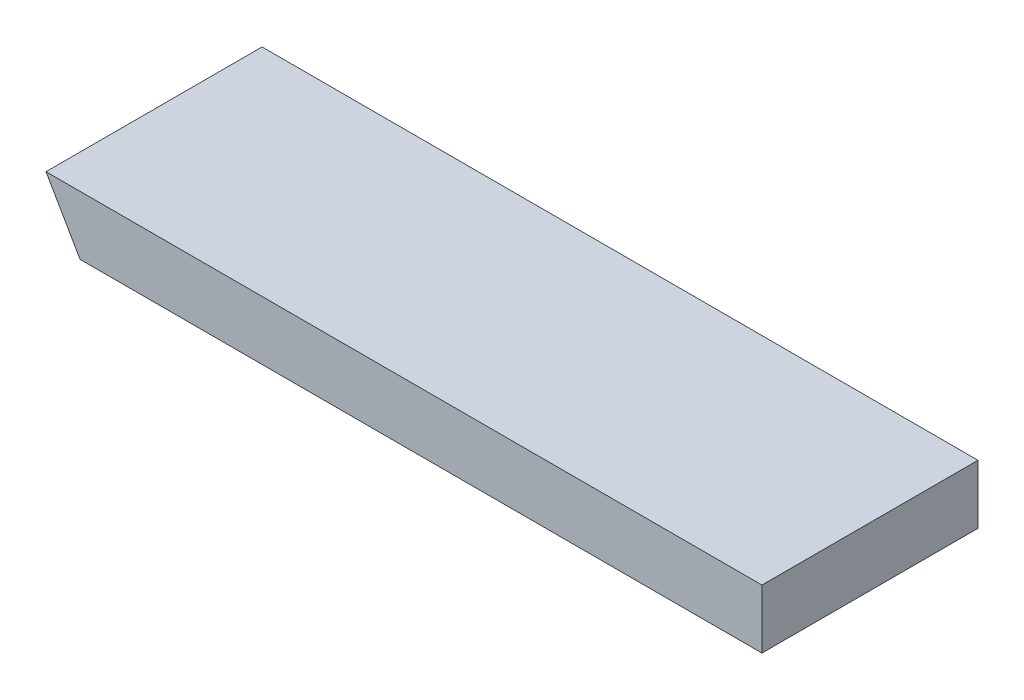
ISO-10303-21;
HEADER;
FILE_DESCRIPTION(('STEP AP214'),'2;1');
FILE_NAME('part.step','',(''),(''),'','','');
FILE_SCHEMA(('AUTOMOTIVE_DESIGN { 1 0 10303 214 1 1 1 1 }'));
ENDSEC;
DATA;
#1=APPLICATION_CONTEXT('core data for automotive mechanical design processes');
#2=APPLICATION_PROTOCOL_DEFINITION('international standard','automotive_design',2000,#1);
#3=PRODUCT_CONTEXT('',#1,'mechanical');
#4=PRODUCT('Part','Part','',(#3));
#5=PRODUCT_RELATED_PRODUCT_CATEGORY('part','',(#4));
#6=PRODUCT_DEFINITION_FORMATION('','',#4);
#7=PRODUCT_DEFINITION_CONTEXT('part definition',#1,'design');
#8=PRODUCT_DEFINITION('design','',#6,#7);
#9=PRODUCT_DEFINITION_SHAPE('','',#8);
#10=(LENGTH_UNIT() NAMED_UNIT(*) SI_UNIT(.MILLI.,.METRE.));
#11=(NAMED_UNIT(*) PLANE_ANGLE_UNIT() SI_UNIT($,.RADIAN.));
#12=(NAMED_UNIT(*) SI_UNIT($,.STERADIAN.) SOLID_ANGLE_UNIT());
#13=UNCERTAINTY_MEASURE_WITH_UNIT(LENGTH_MEASURE(1.E-05),#10,'distance_accuracy_value','');
#14=(GEOMETRIC_REPRESENTATION_CONTEXT(3) GLOBAL_UNCERTAINTY_ASSIGNED_CONTEXT((#13)) GLOBAL_UNIT_ASSIGNED_CONTEXT((#10,
#11,#12)) REPRESENTATION_CONTEXT('',''));
#15=CARTESIAN_POINT('',(0.,0.,0.));
#16=DIRECTION('',(0.,0.,1.));
#17=DIRECTION('',(1.,0.,0.));
#18=AXIS2_PLACEMENT_3D('',#15,#16,#17);
#19=CARTESIAN_POINT('',(0.,38.1,0.));
#20=DIRECTION('',(0.,0.,-1.));
#21=DIRECTION('',(-1.,0.,0.));
#22=AXIS2_PLACEMENT_3D('',#19,#20,#21);
#23=PLANE('',#22);
#24=DIRECTION('',(1.,0.,0.));
#25=VECTOR('',#24,1.);
#26=CARTESIAN_POINT('',(0.,38.1,0.));
#27=LINE('',#26,#25);
#28=CARTESIAN_POINT('',(45.087928126817,38.1000000000004,0.));
#29=VERTEX_POINT('',#28);
#30=CARTESIAN_POINT('',(508.,38.1,0.));
#31=VERTEX_POINT('',#30);
#32=EDGE_CURVE('E83',#29,#31,#27,.T.);
#33=ORIENTED_EDGE('',*,*,#32,.F.);
#34=DIRECTION('',(-0.5,0.866025403784439,0.));
#35=VECTOR('',#34,1.);
#36=CARTESIAN_POINT('',(45.087928126817,38.1000000000004,0.));
#37=LINE('',#36,#35);
#38=CARTESIAN_POINT('',(67.084973382942,0.,0.));
#39=VERTEX_POINT('',#38);
#40=EDGE_CURVE('E94',#39,#29,#37,.T.);
#41=ORIENTED_EDGE('',*,*,#40,.F.);
#42=DIRECTION('',(1.,0.,0.));
#43=VECTOR('',#42,1.);
#44=CARTESIAN_POINT('',(0.,0.,0.));
#45=LINE('',#44,#43);
#46=CARTESIAN_POINT('',(508.,0.,0.));
#47=VERTEX_POINT('',#46);
#48=EDGE_CURVE('E75',#39,#47,#45,.T.);
#49=ORIENTED_EDGE('',*,*,#48,.T.);
#50=DIRECTION('',(0.,-1.,0.));
#51=VECTOR('',#50,1.);
#52=CARTESIAN_POINT('',(508.,38.1,0.));
#53=LINE('',#52,#51);
#54=EDGE_CURVE('E11',#31,#47,#53,.T.);
#55=ORIENTED_EDGE('',*,*,#54,.F.);
#56=EDGE_LOOP('',(#33,#41,#49,#55));
#57=FACE_BOUND('',#56,.T.);
#58=ADVANCED_FACE('F31',(#57),#23,.F.);
#59=CARTESIAN_POINT('',(508.,38.1,0.));
#60=DIRECTION('',(-1.,0.,0.));
#61=DIRECTION('',(0.,0.,1.));
#62=AXIS2_PLACEMENT_3D('',#59,#60,#61);
#63=PLANE('',#62);
#64=DIRECTION('',(0.,0.,-1.));
#65=VECTOR('',#64,1.);
#66=CARTESIAN_POINT('',(508.,0.,0.));
#67=LINE('',#66,#65);
#68=CARTESIAN_POINT('',(508.,0.,-139.7));
#69=VERTEX_POINT('',#68);
#70=EDGE_CURVE('E66',#47,#69,#67,.T.);
#71=ORIENTED_EDGE('',*,*,#70,.T.);
#72=DIRECTION('',(0.,-1.,0.));
#73=VECTOR('',#72,1.);
#74=CARTESIAN_POINT('',(508.,38.1,-139.7));
#75=LINE('',#74,#73);
#76=CARTESIAN_POINT('',(508.,38.1,-139.7));
#77=VERTEX_POINT('',#76);
#78=EDGE_CURVE('E38',#77,#69,#75,.T.);
#79=ORIENTED_EDGE('',*,*,#78,.F.);
#80=DIRECTION('',(0.,0.,-1.));
#81=VECTOR('',#80,1.);
#82=CARTESIAN_POINT('',(508.,38.1,0.));
#83=LINE('',#82,#81);
#84=EDGE_CURVE('E54',#31,#77,#83,.T.);
#85=ORIENTED_EDGE('',*,*,#84,.F.);
#86=ORIENTED_EDGE('',*,*,#54,.T.);
#87=EDGE_LOOP('',(#71,#79,#85,#86));
#88=FACE_BOUND('',#87,.T.);
#89=ADVANCED_FACE('F68',(#88),#63,.F.);
#90=CARTESIAN_POINT('',(0.,38.1,-139.7));
#91=DIRECTION('',(0.,0.,1.));
#92=DIRECTION('',(1.,0.,0.));
#93=AXIS2_PLACEMENT_3D('',#90,#91,#92);
#94=PLANE('',#93);
#95=DIRECTION('',(-1.,0.,0.));
#96=VECTOR('',#95,1.);
#97=CARTESIAN_POINT('',(0.,0.,-139.7));
#98=LINE('',#97,#96);
#99=CARTESIAN_POINT('',(67.084973382942,0.,-139.7));
#100=VERTEX_POINT('',#99);
#101=EDGE_CURVE('E74',#69,#100,#98,.T.);
#102=ORIENTED_EDGE('',*,*,#101,.T.);
#103=DIRECTION('',(-0.5,0.866025403784439,0.));
#104=VECTOR('',#103,1.);
#105=CARTESIAN_POINT('',(45.087928126817,38.1000000000004,-139.7));
#106=LINE('',#105,#104);
#107=CARTESIAN_POINT('',(45.087928126817,38.1000000000004,-139.7));
#108=VERTEX_POINT('',#107);
#109=EDGE_CURVE('E45',#100,#108,#106,.T.);
#110=ORIENTED_EDGE('',*,*,#109,.T.);
#111=DIRECTION('',(-1.,0.,0.));
#112=VECTOR('',#111,1.);
#113=CARTESIAN_POINT('',(0.,38.1,-139.7));
#114=LINE('',#113,#112);
#115=EDGE_CURVE('E80',#77,#108,#114,.T.);
#116=ORIENTED_EDGE('',*,*,#115,.F.);
#117=ORIENTED_EDGE('',*,*,#78,.T.);
#118=EDGE_LOOP('',(#102,#110,#116,#117));
#119=FACE_BOUND('',#118,.T.);
#120=ADVANCED_FACE('F79',(#119),#94,.F.);
#121=CARTESIAN_POINT('',(0.,38.1,-139.7));
#122=DIRECTION('',(0.,-1.,0.));
#123=DIRECTION('',(0.,0.,-1.));
#124=AXIS2_PLACEMENT_3D('',#121,#122,#123);
#125=PLANE('',#124);
#126=ORIENTED_EDGE('',*,*,#115,.T.);
#127=DIRECTION('',(0.,0.,1.));
#128=VECTOR('',#127,1.);
#129=CARTESIAN_POINT('',(45.087928126817,38.1000000000004,-139.7));
#130=LINE('',#129,#128);
#131=EDGE_CURVE('E88',#108,#29,#130,.T.);
#132=ORIENTED_EDGE('',*,*,#131,.T.);
#133=ORIENTED_EDGE('',*,*,#32,.T.);
#134=ORIENTED_EDGE('',*,*,#84,.T.);
#135=EDGE_LOOP('',(#126,#132,#133,#134));
#136=FACE_BOUND('',#135,.T.);
#137=ADVANCED_FACE('F99',(#136),#125,.F.);
#138=CARTESIAN_POINT('',(0.,0.,-139.7));
#139=DIRECTION('',(0.,-1.,0.));
#140=DIRECTION('',(0.,0.,-1.));
#141=AXIS2_PLACEMENT_3D('',#138,#139,#140);
#142=PLANE('',#141);
#143=DIRECTION('',(0.,0.,1.));
#144=VECTOR('',#143,1.);
#145=CARTESIAN_POINT('',(67.084973382942,0.,-139.7));
#146=LINE('',#145,#144);
#147=EDGE_CURVE('E82',#100,#39,#146,.T.);
#148=ORIENTED_EDGE('',*,*,#147,.F.);
#149=ORIENTED_EDGE('',*,*,#101,.F.);
#150=ORIENTED_EDGE('',*,*,#70,.F.);
#151=ORIENTED_EDGE('',*,*,#48,.F.);
#152=EDGE_LOOP('',(#148,#149,#150,#151));
#153=FACE_BOUND('',#152,.T.);
#154=ADVANCED_FACE('F81',(#153),#142,.T.);
#155=CARTESIAN_POINT('',(45.087928126817,38.1000000000004,-139.7));
#156=DIRECTION('',(0.866025403784439,0.5,0.));
#157=DIRECTION('',(-0.5,0.866025403784439,0.));
#158=AXIS2_PLACEMENT_3D('',#155,#156,#157);
#159=PLANE('',#158);
#160=ORIENTED_EDGE('',*,*,#40,.T.);
#161=ORIENTED_EDGE('',*,*,#131,.F.);
#162=ORIENTED_EDGE('',*,*,#109,.F.);
#163=ORIENTED_EDGE('',*,*,#147,.T.);
#164=EDGE_LOOP('',(#160,#161,#162,#163));
#165=FACE_BOUND('',#164,.T.);
#166=ADVANCED_FACE('F105',(#165),#159,.F.);
#167=CLOSED_SHELL('',(#58,#89,#120,#137,#154,#166));
#168=MANIFOLD_SOLID_BREP('B2',#167);
#169=ADVANCED_BREP_SHAPE_REPRESENTATION('',(#18,#168),#14);
#170=SHAPE_DEFINITION_REPRESENTATION(#9,#169);
ENDSEC;
END-ISO-10303-21;
